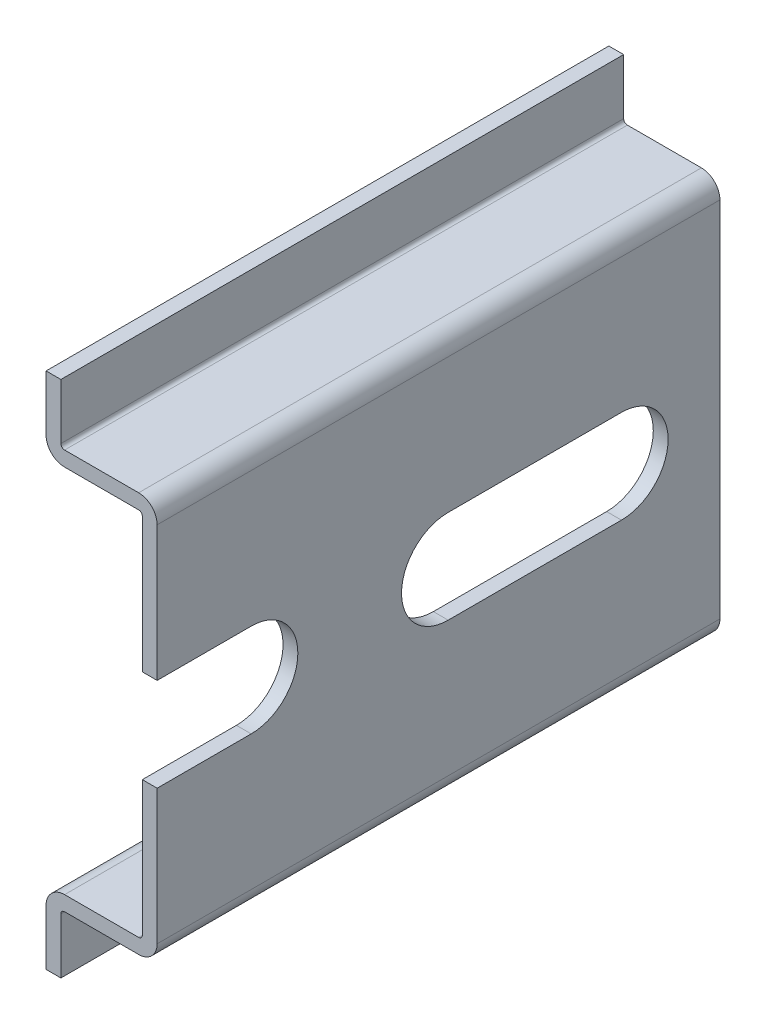
ISO-10303-21;
HEADER;
FILE_DESCRIPTION(('STEP AP214'),'2;1');
FILE_NAME('part.step','',(''),(''),'','','');
FILE_SCHEMA(('AUTOMOTIVE_DESIGN { 1 0 10303 214 1 1 1 1 }'));
ENDSEC;
DATA;
#1=APPLICATION_CONTEXT('core data for automotive mechanical design processes');
#2=APPLICATION_PROTOCOL_DEFINITION('international standard','automotive_design',2000,#1);
#3=PRODUCT_CONTEXT('',#1,'mechanical');
#4=PRODUCT('Part','Part','',(#3));
#5=PRODUCT_RELATED_PRODUCT_CATEGORY('part','',(#4));
#6=PRODUCT_DEFINITION_FORMATION('','',#4);
#7=PRODUCT_DEFINITION_CONTEXT('part definition',#1,'design');
#8=PRODUCT_DEFINITION('design','',#6,#7);
#9=PRODUCT_DEFINITION_SHAPE('','',#8);
#10=(LENGTH_UNIT() NAMED_UNIT(*) SI_UNIT(.MILLI.,.METRE.));
#11=(NAMED_UNIT(*) PLANE_ANGLE_UNIT() SI_UNIT($,.RADIAN.));
#12=(NAMED_UNIT(*) SI_UNIT($,.STERADIAN.) SOLID_ANGLE_UNIT());
#13=UNCERTAINTY_MEASURE_WITH_UNIT(LENGTH_MEASURE(1.E-05),#10,'distance_accuracy_value','');
#14=(GEOMETRIC_REPRESENTATION_CONTEXT(3) GLOBAL_UNCERTAINTY_ASSIGNED_CONTEXT((#13)) GLOBAL_UNIT_ASSIGNED_CONTEXT((#10,
#11,#12)) REPRESENTATION_CONTEXT('',''));
#15=CARTESIAN_POINT('',(0.,0.,0.));
#16=DIRECTION('',(0.,0.,1.));
#17=DIRECTION('',(1.,0.,0.));
#18=AXIS2_PLACEMENT_3D('',#15,#16,#17);
#19=CARTESIAN_POINT('',(-6.5,13.5,50.8));
#20=DIRECTION('',(-1.,0.,0.));
#21=DIRECTION('',(0.,-1.,0.));
#22=AXIS2_PLACEMENT_3D('',#19,#20,#21);
#23=PLANE('',#22);
#24=DIRECTION('',(0.,0.,-1.));
#25=VECTOR('',#24,1.);
#26=CARTESIAN_POINT('',(-6.5,17.5,50.8));
#27=LINE('',#26,#25);
#28=CARTESIAN_POINT('',(-6.5,17.5,38.));
#29=VERTEX_POINT('',#28);
#30=CARTESIAN_POINT('',(-6.5,17.5,0.));
#31=VERTEX_POINT('',#30);
#32=EDGE_CURVE('E239',#29,#31,#27,.T.);
#33=ORIENTED_EDGE('',*,*,#32,.F.);
#34=DIRECTION('',(0.,-1.,0.));
#35=VECTOR('',#34,1.);
#36=CARTESIAN_POINT('',(-6.5,13.5,38.));
#37=LINE('',#36,#35);
#38=CARTESIAN_POINT('',(-6.5,13.75,38.));
#39=VERTEX_POINT('',#38);
#40=EDGE_CURVE('E218',#29,#39,#37,.T.);
#41=ORIENTED_EDGE('',*,*,#40,.T.);
#42=DIRECTION('',(0.,0.,-1.));
#43=VECTOR('',#42,1.);
#44=CARTESIAN_POINT('',(-6.5,13.75,0.));
#45=LINE('',#44,#43);
#46=CARTESIAN_POINT('',(-6.5,13.75,0.));
#47=VERTEX_POINT('',#46);
#48=EDGE_CURVE('E267',#39,#47,#45,.T.);
#49=ORIENTED_EDGE('',*,*,#48,.T.);
#50=DIRECTION('',(0.,1.,0.));
#51=VECTOR('',#50,1.);
#52=CARTESIAN_POINT('',(-6.5,13.5,0.));
#53=LINE('',#52,#51);
#54=EDGE_CURVE('E439',#47,#31,#53,.T.);
#55=ORIENTED_EDGE('',*,*,#54,.T.);
#56=EDGE_LOOP('',(#33,#41,#49,#55));
#57=FACE_BOUND('',#56,.T.);
#58=ADVANCED_FACE('F33',(#57),#23,.F.);
#59=CARTESIAN_POINT('',(-7.5,17.5,50.8));
#60=DIRECTION('',(0.,1.,0.));
#61=DIRECTION('',(0.,0.,1.));
#62=AXIS2_PLACEMENT_3D('',#59,#60,#61);
#63=PLANE('',#62);
#64=DIRECTION('',(-1.,0.,0.));
#65=VECTOR('',#64,1.);
#66=CARTESIAN_POINT('',(0.,17.5,38.));
#67=LINE('',#66,#65);
#68=CARTESIAN_POINT('',(-7.5,17.5,38.));
#69=VERTEX_POINT('',#68);
#70=EDGE_CURVE('E215',#29,#69,#67,.T.);
#71=ORIENTED_EDGE('',*,*,#70,.F.);
#72=ORIENTED_EDGE('',*,*,#32,.T.);
#73=DIRECTION('',(1.,0.,0.));
#74=VECTOR('',#73,1.);
#75=CARTESIAN_POINT('',(-7.5,17.5,0.));
#76=LINE('',#75,#74);
#77=CARTESIAN_POINT('',(-7.5,17.5,0.));
#78=VERTEX_POINT('',#77);
#79=EDGE_CURVE('E238',#78,#31,#76,.T.);
#80=ORIENTED_EDGE('',*,*,#79,.F.);
#81=DIRECTION('',(0.,0.,-1.));
#82=VECTOR('',#81,1.);
#83=CARTESIAN_POINT('',(-7.5,17.5,50.8));
#84=LINE('',#83,#82);
#85=EDGE_CURVE('E229',#69,#78,#84,.T.);
#86=ORIENTED_EDGE('',*,*,#85,.F.);
#87=EDGE_LOOP('',(#71,#72,#80,#86));
#88=FACE_BOUND('',#87,.T.);
#89=ADVANCED_FACE('F236',(#88),#63,.T.);
#90=CARTESIAN_POINT('',(-7.5,13.5,50.8));
#91=DIRECTION('',(-1.,0.,0.));
#92=DIRECTION('',(0.,-1.,0.));
#93=AXIS2_PLACEMENT_3D('',#90,#91,#92);
#94=PLANE('',#93);
#95=DIRECTION('',(0.,-1.,0.));
#96=VECTOR('',#95,1.);
#97=CARTESIAN_POINT('',(-7.5,17.5,38.));
#98=LINE('',#97,#96);
#99=CARTESIAN_POINT('',(-7.5,13.75,38.));
#100=VERTEX_POINT('',#99);
#101=EDGE_CURVE('E55',#69,#100,#98,.T.);
#102=ORIENTED_EDGE('',*,*,#101,.F.);
#103=ORIENTED_EDGE('',*,*,#85,.T.);
#104=DIRECTION('',(0.,1.,0.));
#105=VECTOR('',#104,1.);
#106=CARTESIAN_POINT('',(-7.5,13.5,0.));
#107=LINE('',#106,#105);
#108=CARTESIAN_POINT('',(-7.5,13.75,0.));
#109=VERTEX_POINT('',#108);
#110=EDGE_CURVE('E337',#109,#78,#107,.T.);
#111=ORIENTED_EDGE('',*,*,#110,.F.);
#112=DIRECTION('',(0.,0.,-1.));
#113=VECTOR('',#112,1.);
#114=CARTESIAN_POINT('',(-7.5,13.75,50.8));
#115=LINE('',#114,#113);
#116=EDGE_CURVE('E41',#109,#100,#115,.F.);
#117=ORIENTED_EDGE('',*,*,#116,.T.);
#118=EDGE_LOOP('',(#102,#103,#111,#117));
#119=FACE_BOUND('',#118,.T.);
#120=ADVANCED_FACE('F227',(#119),#94,.T.);
#121=CARTESIAN_POINT('',(0.,12.5,50.8));
#122=DIRECTION('',(0.,-1.,0.));
#123=DIRECTION('',(1.,0.,0.));
#124=AXIS2_PLACEMENT_3D('',#121,#122,#123);
#125=PLANE('',#124);
#126=DIRECTION('',(1.,0.,0.));
#127=VECTOR('',#126,1.);
#128=CARTESIAN_POINT('',(0.,12.5,38.));
#129=LINE('',#128,#127);
#130=CARTESIAN_POINT('',(-6.25,12.5,38.));
#131=VERTEX_POINT('',#130);
#132=CARTESIAN_POINT('',(-1.25,12.5,38.));
#133=VERTEX_POINT('',#132);
#134=EDGE_CURVE('E329',#131,#133,#129,.T.);
#135=ORIENTED_EDGE('',*,*,#134,.F.);
#136=DIRECTION('',(0.,0.,-1.));
#137=VECTOR('',#136,1.);
#138=CARTESIAN_POINT('',(-6.25,12.5,50.8));
#139=LINE('',#138,#137);
#140=CARTESIAN_POINT('',(-6.25,12.5,0.));
#141=VERTEX_POINT('',#140);
#142=EDGE_CURVE('E319',#131,#141,#139,.T.);
#143=ORIENTED_EDGE('',*,*,#142,.T.);
#144=DIRECTION('',(-1.,0.,0.));
#145=VECTOR('',#144,1.);
#146=CARTESIAN_POINT('',(0.,12.5,0.));
#147=LINE('',#146,#145);
#148=CARTESIAN_POINT('',(-1.25,12.5,0.));
#149=VERTEX_POINT('',#148);
#150=EDGE_CURVE('E327',#149,#141,#147,.T.);
#151=ORIENTED_EDGE('',*,*,#150,.F.);
#152=DIRECTION('',(0.,0.,-1.));
#153=VECTOR('',#152,1.);
#154=CARTESIAN_POINT('',(-1.25,12.5,50.8));
#155=LINE('',#154,#153);
#156=EDGE_CURVE('E282',#149,#133,#155,.F.);
#157=ORIENTED_EDGE('',*,*,#156,.T.);
#158=EDGE_LOOP('',(#135,#143,#151,#157));
#159=FACE_BOUND('',#158,.T.);
#160=ADVANCED_FACE('F325',(#159),#125,.T.);
#161=CARTESIAN_POINT('',(-1.,-13.5,50.8));
#162=DIRECTION('',(-1.,0.,0.));
#163=DIRECTION('',(0.,-1.,0.));
#164=AXIS2_PLACEMENT_3D('',#161,#162,#163);
#165=PLANE('',#164);
#166=DIRECTION('',(0.,-1.,0.));
#167=VECTOR('',#166,1.);
#168=CARTESIAN_POINT('',(-1.,-13.5,38.));
#169=LINE('',#168,#167);
#170=CARTESIAN_POINT('',(-1.,12.25,38.));
#171=VERTEX_POINT('',#170);
#172=CARTESIAN_POINT('',(-1.,3.15,38.));
#173=VERTEX_POINT('',#172);
#174=EDGE_CURVE('E474',#171,#173,#169,.T.);
#175=ORIENTED_EDGE('',*,*,#174,.F.);
#176=DIRECTION('',(0.,0.,-1.));
#177=VECTOR('',#176,1.);
#178=CARTESIAN_POINT('',(-1.,12.25,0.));
#179=LINE('',#178,#177);
#180=CARTESIAN_POINT('',(-1.,12.25,0.));
#181=VERTEX_POINT('',#180);
#182=EDGE_CURVE('E280',#171,#181,#179,.T.);
#183=ORIENTED_EDGE('',*,*,#182,.T.);
#184=DIRECTION('',(0.,1.,0.));
#185=VECTOR('',#184,1.);
#186=CARTESIAN_POINT('',(-1.,-13.5,0.));
#187=LINE('',#186,#185);
#188=CARTESIAN_POINT('',(-1.,-12.25,0.));
#189=VERTEX_POINT('',#188);
#190=EDGE_CURVE('E336',#189,#181,#187,.T.);
#191=ORIENTED_EDGE('',*,*,#190,.F.);
#192=DIRECTION('',(0.,0.,-1.));
#193=VECTOR('',#192,1.);
#194=CARTESIAN_POINT('',(-1.,-12.25,50.8));
#195=LINE('',#194,#193);
#196=CARTESIAN_POINT('',(-1.,-12.25,38.));
#197=VERTEX_POINT('',#196);
#198=EDGE_CURVE('E277',#189,#197,#195,.F.);
#199=ORIENTED_EDGE('',*,*,#198,.T.);
#200=CARTESIAN_POINT('',(-1.,-3.15,38.));
#201=VERTEX_POINT('',#200);
#202=EDGE_CURVE('E402',#201,#197,#169,.T.);
#203=ORIENTED_EDGE('',*,*,#202,.F.);
#204=DIRECTION('',(0.,0.,1.));
#205=VECTOR('',#204,1.);
#206=CARTESIAN_POINT('',(-1.,-3.15,50.8));
#207=LINE('',#206,#205);
#208=CARTESIAN_POINT('',(-1.,-3.15,31.65));
#209=VERTEX_POINT('',#208);
#210=EDGE_CURVE('E414',#209,#201,#207,.T.);
#211=ORIENTED_EDGE('',*,*,#210,.F.);
#212=CARTESIAN_POINT('',(-1.,0.,31.65));
#213=DIRECTION('',(-1.,0.,0.));
#214=DIRECTION('',(0.,-1.,0.));
#215=AXIS2_PLACEMENT_3D('',#212,#213,#214);
#216=CIRCLE('',#215,3.14999999999999);
#217=CARTESIAN_POINT('',(-1.00000000000001,3.14999999999999,31.65));
#218=VERTEX_POINT('',#217);
#219=EDGE_CURVE('E417',#218,#209,#216,.T.);
#220=ORIENTED_EDGE('',*,*,#219,.F.);
#221=DIRECTION('',(0.,0.,-1.));
#222=VECTOR('',#221,1.);
#223=CARTESIAN_POINT('',(-1.,3.14999999999999,50.8));
#224=LINE('',#223,#222);
#225=EDGE_CURVE('E410',#173,#218,#224,.T.);
#226=ORIENTED_EDGE('',*,*,#225,.F.);
#227=EDGE_LOOP('',(#175,#183,#191,#199,#203,#211,#220,#226));
#228=FACE_BOUND('',#227,.T.);
#229=CARTESIAN_POINT('',(-1.,0.,6.65));
#230=DIRECTION('',(-1.,0.,0.));
#231=DIRECTION('',(0.,-1.,0.));
#232=AXIS2_PLACEMENT_3D('',#229,#230,#231);
#233=CIRCLE('',#232,3.14999999999999);
#234=CARTESIAN_POINT('',(-1.00000000000001,3.14999999999999,6.65));
#235=VERTEX_POINT('',#234);
#236=CARTESIAN_POINT('',(-1.,-3.15,6.65));
#237=VERTEX_POINT('',#236);
#238=EDGE_CURVE('E437',#235,#237,#233,.T.);
#239=ORIENTED_EDGE('',*,*,#238,.F.);
#240=DIRECTION('',(0.,0.,-1.));
#241=VECTOR('',#240,1.);
#242=CARTESIAN_POINT('',(-1.,3.15,50.8));
#243=LINE('',#242,#241);
#244=CARTESIAN_POINT('',(-1.,3.14999999999999,18.35));
#245=VERTEX_POINT('',#244);
#246=EDGE_CURVE('E427',#245,#235,#243,.T.);
#247=ORIENTED_EDGE('',*,*,#246,.F.);
#248=CARTESIAN_POINT('',(-1.,0.,18.35));
#249=DIRECTION('',(-1.,0.,0.));
#250=DIRECTION('',(0.,-1.,0.));
#251=AXIS2_PLACEMENT_3D('',#248,#249,#250);
#252=CIRCLE('',#251,3.14999999999999);
#253=CARTESIAN_POINT('',(-1.,-3.15,18.35));
#254=VERTEX_POINT('',#253);
#255=EDGE_CURVE('E432',#254,#245,#252,.T.);
#256=ORIENTED_EDGE('',*,*,#255,.F.);
#257=DIRECTION('',(0.,0.,1.));
#258=VECTOR('',#257,1.);
#259=CARTESIAN_POINT('',(-1.,-3.14999999999999,50.8));
#260=LINE('',#259,#258);
#261=EDGE_CURVE('E435',#237,#254,#260,.T.);
#262=ORIENTED_EDGE('',*,*,#261,.F.);
#263=EDGE_LOOP('',(#239,#247,#256,#262));
#264=FACE_BOUND('',#263,.T.);
#265=ADVANCED_FACE('F506',(#228,#264),#165,.T.);
#266=CARTESIAN_POINT('',(0.,-12.5,50.8));
#267=DIRECTION('',(0.,1.,0.));
#268=DIRECTION('',(-1.,0.,0.));
#269=AXIS2_PLACEMENT_3D('',#266,#267,#268);
#270=PLANE('',#269);
#271=DIRECTION('',(-1.,0.,0.));
#272=VECTOR('',#271,1.);
#273=CARTESIAN_POINT('',(0.,-12.5,38.));
#274=LINE('',#273,#272);
#275=CARTESIAN_POINT('',(-1.25,-12.5,38.));
#276=VERTEX_POINT('',#275);
#277=CARTESIAN_POINT('',(-6.25,-12.5,38.));
#278=VERTEX_POINT('',#277);
#279=EDGE_CURVE('E392',#276,#278,#274,.T.);
#280=ORIENTED_EDGE('',*,*,#279,.F.);
#281=DIRECTION('',(0.,0.,-1.));
#282=VECTOR('',#281,1.);
#283=CARTESIAN_POINT('',(-1.25,-12.5,0.));
#284=LINE('',#283,#282);
#285=CARTESIAN_POINT('',(-1.25,-12.5,0.));
#286=VERTEX_POINT('',#285);
#287=EDGE_CURVE('E285',#276,#286,#284,.T.);
#288=ORIENTED_EDGE('',*,*,#287,.T.);
#289=DIRECTION('',(1.,0.,0.));
#290=VECTOR('',#289,1.);
#291=CARTESIAN_POINT('',(0.,-12.5,0.));
#292=LINE('',#291,#290);
#293=CARTESIAN_POINT('',(-6.25,-12.5,0.));
#294=VERTEX_POINT('',#293);
#295=EDGE_CURVE('E339',#294,#286,#292,.T.);
#296=ORIENTED_EDGE('',*,*,#295,.F.);
#297=DIRECTION('',(0.,0.,-1.));
#298=VECTOR('',#297,1.);
#299=CARTESIAN_POINT('',(-6.25,-12.5,50.8));
#300=LINE('',#299,#298);
#301=EDGE_CURVE('E306',#294,#278,#300,.F.);
#302=ORIENTED_EDGE('',*,*,#301,.T.);
#303=EDGE_LOOP('',(#280,#288,#296,#302));
#304=FACE_BOUND('',#303,.T.);
#305=ADVANCED_FACE('F387',(#304),#270,.T.);
#306=CARTESIAN_POINT('',(-7.5,-13.5,50.8));
#307=DIRECTION('',(-1.,0.,0.));
#308=DIRECTION('',(0.,-1.,0.));
#309=AXIS2_PLACEMENT_3D('',#306,#307,#308);
#310=PLANE('',#309);
#311=CARTESIAN_POINT('',(-7.5,-13.75,38.));
#312=VERTEX_POINT('',#311);
#313=CARTESIAN_POINT('',(-7.50000000000001,-17.5,38.));
#314=VERTEX_POINT('',#313);
#315=EDGE_CURVE('E233',#312,#314,#98,.T.);
#316=ORIENTED_EDGE('',*,*,#315,.F.);
#317=DIRECTION('',(0.,0.,-1.));
#318=VECTOR('',#317,1.);
#319=CARTESIAN_POINT('',(-7.5,-13.75,50.8));
#320=LINE('',#319,#318);
#321=CARTESIAN_POINT('',(-7.5,-13.75,0.));
#322=VERTEX_POINT('',#321);
#323=EDGE_CURVE('E296',#312,#322,#320,.T.);
#324=ORIENTED_EDGE('',*,*,#323,.T.);
#325=DIRECTION('',(0.,1.,0.));
#326=VECTOR('',#325,1.);
#327=CARTESIAN_POINT('',(-7.5,-13.5,0.));
#328=LINE('',#327,#326);
#329=CARTESIAN_POINT('',(-7.5,-17.5,0.));
#330=VERTEX_POINT('',#329);
#331=EDGE_CURVE('E346',#330,#322,#328,.T.);
#332=ORIENTED_EDGE('',*,*,#331,.F.);
#333=DIRECTION('',(0.,0.,-1.));
#334=VECTOR('',#333,1.);
#335=CARTESIAN_POINT('',(-7.5,-17.5,50.8));
#336=LINE('',#335,#334);
#337=EDGE_CURVE('E240',#314,#330,#336,.T.);
#338=ORIENTED_EDGE('',*,*,#337,.F.);
#339=EDGE_LOOP('',(#316,#324,#332,#338));
#340=FACE_BOUND('',#339,.T.);
#341=ADVANCED_FACE('F378',(#340),#310,.T.);
#342=CARTESIAN_POINT('',(-6.5,-17.5,50.8));
#343=DIRECTION('',(0.,-1.,0.));
#344=DIRECTION('',(0.,0.,-1.));
#345=AXIS2_PLACEMENT_3D('',#342,#343,#344);
#346=PLANE('',#345);
#347=DIRECTION('',(-1.,0.,0.));
#348=VECTOR('',#347,1.);
#349=CARTESIAN_POINT('',(0.,-17.5,38.));
#350=LINE('',#349,#348);
#351=CARTESIAN_POINT('',(-6.5,-17.5,38.));
#352=VERTEX_POINT('',#351);
#353=EDGE_CURVE('E222',#352,#314,#350,.T.);
#354=ORIENTED_EDGE('',*,*,#353,.T.);
#355=ORIENTED_EDGE('',*,*,#337,.T.);
#356=DIRECTION('',(-1.,0.,0.));
#357=VECTOR('',#356,1.);
#358=CARTESIAN_POINT('',(-6.5,-17.5,0.));
#359=LINE('',#358,#357);
#360=CARTESIAN_POINT('',(-6.5,-17.5,0.));
#361=VERTEX_POINT('',#360);
#362=EDGE_CURVE('E348',#361,#330,#359,.T.);
#363=ORIENTED_EDGE('',*,*,#362,.F.);
#364=DIRECTION('',(0.,0.,-1.));
#365=VECTOR('',#364,1.);
#366=CARTESIAN_POINT('',(-6.5,-17.5,50.8));
#367=LINE('',#366,#365);
#368=EDGE_CURVE('E244',#352,#361,#367,.T.);
#369=ORIENTED_EDGE('',*,*,#368,.F.);
#370=EDGE_LOOP('',(#354,#355,#363,#369));
#371=FACE_BOUND('',#370,.T.);
#372=ADVANCED_FACE('F373',(#371),#346,.T.);
#373=CARTESIAN_POINT('',(-6.5,-13.5,50.8));
#374=DIRECTION('',(-1.,0.,0.));
#375=DIRECTION('',(0.,-1.,0.));
#376=AXIS2_PLACEMENT_3D('',#373,#374,#375);
#377=PLANE('',#376);
#378=DIRECTION('',(0.,0.,-1.));
#379=VECTOR('',#378,1.);
#380=CARTESIAN_POINT('',(-6.5,-13.75,50.8));
#381=LINE('',#380,#379);
#382=CARTESIAN_POINT('',(-6.5,-13.75,0.));
#383=VERTEX_POINT('',#382);
#384=CARTESIAN_POINT('',(-6.5,-13.75,38.));
#385=VERTEX_POINT('',#384);
#386=EDGE_CURVE('E274',#383,#385,#381,.F.);
#387=ORIENTED_EDGE('',*,*,#386,.T.);
#388=DIRECTION('',(0.,-1.,0.));
#389=VECTOR('',#388,1.);
#390=CARTESIAN_POINT('',(-6.5,-13.5,38.));
#391=LINE('',#390,#389);
#392=EDGE_CURVE('E367',#385,#352,#391,.T.);
#393=ORIENTED_EDGE('',*,*,#392,.T.);
#394=ORIENTED_EDGE('',*,*,#368,.T.);
#395=DIRECTION('',(0.,1.,0.));
#396=VECTOR('',#395,1.);
#397=CARTESIAN_POINT('',(-6.5,-13.5,0.));
#398=LINE('',#397,#396);
#399=EDGE_CURVE('E351',#361,#383,#398,.T.);
#400=ORIENTED_EDGE('',*,*,#399,.T.);
#401=EDGE_LOOP('',(#387,#393,#394,#400));
#402=FACE_BOUND('',#401,.T.);
#403=ADVANCED_FACE('F365',(#402),#377,.F.);
#404=CARTESIAN_POINT('',(0.,-13.5,50.8));
#405=DIRECTION('',(0.,1.,0.));
#406=DIRECTION('',(-1.,0.,0.));
#407=AXIS2_PLACEMENT_3D('',#404,#405,#406);
#408=PLANE('',#407);
#409=DIRECTION('',(0.,0.,-1.));
#410=VECTOR('',#409,1.);
#411=CARTESIAN_POINT('',(-1.25,-13.5,50.8));
#412=LINE('',#411,#410);
#413=CARTESIAN_POINT('',(-1.25,-13.5,0.));
#414=VERTEX_POINT('',#413);
#415=CARTESIAN_POINT('',(-1.25,-13.5,38.));
#416=VERTEX_POINT('',#415);
#417=EDGE_CURVE('E314',#414,#416,#412,.F.);
#418=ORIENTED_EDGE('',*,*,#417,.T.);
#419=DIRECTION('',(-1.,0.,0.));
#420=VECTOR('',#419,1.);
#421=CARTESIAN_POINT('',(0.,-13.5,38.));
#422=LINE('',#421,#420);
#423=CARTESIAN_POINT('',(-6.25,-13.5,38.));
#424=VERTEX_POINT('',#423);
#425=EDGE_CURVE('E48',#416,#424,#422,.T.);
#426=ORIENTED_EDGE('',*,*,#425,.T.);
#427=DIRECTION('',(0.,0.,-1.));
#428=VECTOR('',#427,1.);
#429=CARTESIAN_POINT('',(-6.25,-13.5,0.));
#430=LINE('',#429,#428);
#431=CARTESIAN_POINT('',(-6.25,-13.5,0.));
#432=VERTEX_POINT('',#431);
#433=EDGE_CURVE('E272',#424,#432,#430,.T.);
#434=ORIENTED_EDGE('',*,*,#433,.T.);
#435=DIRECTION('',(1.,0.,0.));
#436=VECTOR('',#435,1.);
#437=CARTESIAN_POINT('',(0.,-13.5,0.));
#438=LINE('',#437,#436);
#439=EDGE_CURVE('E354',#432,#414,#438,.T.);
#440=ORIENTED_EDGE('',*,*,#439,.T.);
#441=EDGE_LOOP('',(#418,#426,#434,#440));
#442=FACE_BOUND('',#441,.T.);
#443=ADVANCED_FACE('F488',(#442),#408,.F.);
#444=CARTESIAN_POINT('',(0.,-13.5,50.8));
#445=DIRECTION('',(-1.,0.,0.));
#446=DIRECTION('',(0.,-1.,0.));
#447=AXIS2_PLACEMENT_3D('',#444,#445,#446);
#448=PLANE('',#447);
#449=DIRECTION('',(0.,0.,-1.));
#450=VECTOR('',#449,1.);
#451=CARTESIAN_POINT('',(0.,12.25,50.8));
#452=LINE('',#451,#450);
#453=CARTESIAN_POINT('',(0.,12.25,0.));
#454=VERTEX_POINT('',#453);
#455=CARTESIAN_POINT('',(0.,12.25,38.));
#456=VERTEX_POINT('',#455);
#457=EDGE_CURVE('E309',#454,#456,#452,.F.);
#458=ORIENTED_EDGE('',*,*,#457,.T.);
#459=DIRECTION('',(0.,-1.,0.));
#460=VECTOR('',#459,1.);
#461=CARTESIAN_POINT('',(0.,17.5,38.));
#462=LINE('',#461,#460);
#463=CARTESIAN_POINT('',(0.,3.14999999999999,38.));
#464=VERTEX_POINT('',#463);
#465=EDGE_CURVE('E223',#456,#464,#462,.T.);
#466=ORIENTED_EDGE('',*,*,#465,.T.);
#467=DIRECTION('',(0.,0.,1.));
#468=VECTOR('',#467,1.);
#469=CARTESIAN_POINT('',(0.,3.14999999999999,50.8));
#470=LINE('',#469,#468);
#471=CARTESIAN_POINT('',(0.,3.14999999999999,31.65));
#472=VERTEX_POINT('',#471);
#473=EDGE_CURVE('E259',#464,#472,#470,.F.);
#474=ORIENTED_EDGE('',*,*,#473,.T.);
#475=CARTESIAN_POINT('',(0.,0.,31.65));
#476=DIRECTION('',(1.,0.,0.));
#477=DIRECTION('',(0.,0.,-1.));
#478=AXIS2_PLACEMENT_3D('',#475,#476,#477);
#479=CIRCLE('',#478,3.14999999999999);
#480=CARTESIAN_POINT('',(0.,-3.15,31.65));
#481=VERTEX_POINT('',#480);
#482=EDGE_CURVE('E264',#472,#481,#479,.F.);
#483=ORIENTED_EDGE('',*,*,#482,.T.);
#484=DIRECTION('',(0.,0.,1.));
#485=VECTOR('',#484,1.);
#486=CARTESIAN_POINT('',(0.,-3.15,50.8));
#487=LINE('',#486,#485);
#488=CARTESIAN_POINT('',(0.,-3.15,38.));
#489=VERTEX_POINT('',#488);
#490=EDGE_CURVE('E261',#481,#489,#487,.T.);
#491=ORIENTED_EDGE('',*,*,#490,.T.);
#492=CARTESIAN_POINT('',(0.,-12.25,38.));
#493=VERTEX_POINT('',#492);
#494=EDGE_CURVE('E232',#489,#493,#462,.T.);
#495=ORIENTED_EDGE('',*,*,#494,.T.);
#496=DIRECTION('',(0.,0.,-1.));
#497=VECTOR('',#496,1.);
#498=CARTESIAN_POINT('',(0.,-12.25,50.8));
#499=LINE('',#498,#497);
#500=CARTESIAN_POINT('',(0.,-12.25,0.));
#501=VERTEX_POINT('',#500);
#502=EDGE_CURVE('E312',#493,#501,#499,.T.);
#503=ORIENTED_EDGE('',*,*,#502,.T.);
#504=DIRECTION('',(0.,1.,0.));
#505=VECTOR('',#504,1.);
#506=CARTESIAN_POINT('',(0.,-13.5,0.));
#507=LINE('',#506,#505);
#508=EDGE_CURVE('E357',#501,#454,#507,.T.);
#509=ORIENTED_EDGE('',*,*,#508,.T.);
#510=EDGE_LOOP('',(#458,#466,#474,#483,#491,#495,#503,#509));
#511=FACE_BOUND('',#510,.T.);
#512=DIRECTION('',(0.,0.,1.));
#513=VECTOR('',#512,1.);
#514=CARTESIAN_POINT('',(0.,3.14999999999999,50.8));
#515=LINE('',#514,#513);
#516=CARTESIAN_POINT('',(0.,3.15,18.35));
#517=VERTEX_POINT('',#516);
#518=CARTESIAN_POINT('',(0.,3.14999999999999,6.65));
#519=VERTEX_POINT('',#518);
#520=EDGE_CURVE('E242',#517,#519,#515,.F.);
#521=ORIENTED_EDGE('',*,*,#520,.T.);
#522=CARTESIAN_POINT('',(0.,0.,6.65));
#523=DIRECTION('',(1.,0.,0.));
#524=DIRECTION('',(0.,0.,-1.));
#525=AXIS2_PLACEMENT_3D('',#522,#523,#524);
#526=CIRCLE('',#525,3.14999999999999);
#527=CARTESIAN_POINT('',(0.,-3.15,6.65));
#528=VERTEX_POINT('',#527);
#529=EDGE_CURVE('E256',#519,#528,#526,.F.);
#530=ORIENTED_EDGE('',*,*,#529,.T.);
#531=DIRECTION('',(0.,0.,1.));
#532=VECTOR('',#531,1.);
#533=CARTESIAN_POINT('',(0.,-3.15,50.8));
#534=LINE('',#533,#532);
#535=CARTESIAN_POINT('',(0.,-3.15,18.35));
#536=VERTEX_POINT('',#535);
#537=EDGE_CURVE('E253',#528,#536,#534,.T.);
#538=ORIENTED_EDGE('',*,*,#537,.T.);
#539=CARTESIAN_POINT('',(0.,0.,18.35));
#540=DIRECTION('',(1.,0.,0.));
#541=DIRECTION('',(0.,0.,-1.));
#542=AXIS2_PLACEMENT_3D('',#539,#540,#541);
#543=CIRCLE('',#542,3.14999999999999);
#544=EDGE_CURVE('E250',#536,#517,#543,.F.);
#545=ORIENTED_EDGE('',*,*,#544,.T.);
#546=EDGE_LOOP('',(#521,#530,#538,#545));
#547=FACE_BOUND('',#546,.T.);
#548=ADVANCED_FACE('F461',(#511,#547),#448,.F.);
#549=CARTESIAN_POINT('',(0.,13.5,50.8));
#550=DIRECTION('',(0.,-1.,0.));
#551=DIRECTION('',(1.,0.,0.));
#552=AXIS2_PLACEMENT_3D('',#549,#550,#551);
#553=PLANE('',#552);
#554=DIRECTION('',(0.,0.,-1.));
#555=VECTOR('',#554,1.);
#556=CARTESIAN_POINT('',(-6.25,13.5,50.8));
#557=LINE('',#556,#555);
#558=CARTESIAN_POINT('',(-6.25,13.5,0.));
#559=VERTEX_POINT('',#558);
#560=CARTESIAN_POINT('',(-6.25,13.5,38.));
#561=VERTEX_POINT('',#560);
#562=EDGE_CURVE('E269',#559,#561,#557,.F.);
#563=ORIENTED_EDGE('',*,*,#562,.T.);
#564=DIRECTION('',(1.,0.,0.));
#565=VECTOR('',#564,1.);
#566=CARTESIAN_POINT('',(0.,13.5,38.));
#567=LINE('',#566,#565);
#568=CARTESIAN_POINT('',(-1.25000000000001,13.5,38.));
#569=VERTEX_POINT('',#568);
#570=EDGE_CURVE('E454',#561,#569,#567,.T.);
#571=ORIENTED_EDGE('',*,*,#570,.T.);
#572=DIRECTION('',(0.,0.,-1.));
#573=VECTOR('',#572,1.);
#574=CARTESIAN_POINT('',(-1.25000000000001,13.5,50.8));
#575=LINE('',#574,#573);
#576=CARTESIAN_POINT('',(-1.25000000000001,13.5,0.));
#577=VERTEX_POINT('',#576);
#578=EDGE_CURVE('E317',#569,#577,#575,.T.);
#579=ORIENTED_EDGE('',*,*,#578,.T.);
#580=DIRECTION('',(-1.,0.,0.));
#581=VECTOR('',#580,1.);
#582=CARTESIAN_POINT('',(0.,13.5,0.));
#583=LINE('',#582,#581);
#584=EDGE_CURVE('E360',#577,#559,#583,.T.);
#585=ORIENTED_EDGE('',*,*,#584,.T.);
#586=EDGE_LOOP('',(#563,#571,#579,#585));
#587=FACE_BOUND('',#586,.T.);
#588=ADVANCED_FACE('F453',(#587),#553,.F.);
#589=CARTESIAN_POINT('',(0.,0.,0.));
#590=DIRECTION('',(0.,0.,-1.));
#591=DIRECTION('',(-1.,0.,0.));
#592=AXIS2_PLACEMENT_3D('',#589,#590,#591);
#593=PLANE('',#592);
#594=ORIENTED_EDGE('',*,*,#331,.T.);
#595=CARTESIAN_POINT('',(-6.25,-13.75,0.));
#596=DIRECTION('',(0.,0.,-1.));
#597=DIRECTION('',(-1.,0.,0.));
#598=AXIS2_PLACEMENT_3D('',#595,#596,#597);
#599=CIRCLE('',#598,1.25);
#600=EDGE_CURVE('E304',#322,#294,#599,.T.);
#601=ORIENTED_EDGE('',*,*,#600,.T.);
#602=ORIENTED_EDGE('',*,*,#295,.T.);
#603=CARTESIAN_POINT('',(-1.25,-12.25,0.));
#604=DIRECTION('',(0.,0.,-1.));
#605=DIRECTION('',(-1.,0.,0.));
#606=AXIS2_PLACEMENT_3D('',#603,#604,#605);
#607=CIRCLE('',#606,0.25);
#608=EDGE_CURVE('E294',#286,#189,#607,.F.);
#609=ORIENTED_EDGE('',*,*,#608,.T.);
#610=ORIENTED_EDGE('',*,*,#190,.T.);
#611=CARTESIAN_POINT('',(-1.25,12.25,0.));
#612=DIRECTION('',(0.,0.,-1.));
#613=DIRECTION('',(-1.,0.,0.));
#614=AXIS2_PLACEMENT_3D('',#611,#612,#613);
#615=CIRCLE('',#614,0.25);
#616=EDGE_CURVE('E292',#181,#149,#615,.F.);
#617=ORIENTED_EDGE('',*,*,#616,.T.);
#618=ORIENTED_EDGE('',*,*,#150,.T.);
#619=CARTESIAN_POINT('',(-6.25,13.75,0.));
#620=DIRECTION('',(0.,0.,-1.));
#621=DIRECTION('',(-1.,0.,0.));
#622=AXIS2_PLACEMENT_3D('',#619,#620,#621);
#623=CIRCLE('',#622,1.25);
#624=EDGE_CURVE('E298',#141,#109,#623,.T.);
#625=ORIENTED_EDGE('',*,*,#624,.T.);
#626=ORIENTED_EDGE('',*,*,#110,.T.);
#627=ORIENTED_EDGE('',*,*,#79,.T.);
#628=ORIENTED_EDGE('',*,*,#54,.F.);
#629=CARTESIAN_POINT('',(-6.25,13.75,0.));
#630=DIRECTION('',(0.,0.,-1.));
#631=DIRECTION('',(-1.,0.,0.));
#632=AXIS2_PLACEMENT_3D('',#629,#630,#631);
#633=CIRCLE('',#632,0.25);
#634=EDGE_CURVE('E287',#47,#559,#633,.F.);
#635=ORIENTED_EDGE('',*,*,#634,.T.);
#636=ORIENTED_EDGE('',*,*,#584,.F.);
#637=CARTESIAN_POINT('',(-1.25,12.25,0.));
#638=DIRECTION('',(0.,0.,-1.));
#639=DIRECTION('',(-1.,0.,0.));
#640=AXIS2_PLACEMENT_3D('',#637,#638,#639);
#641=CIRCLE('',#640,1.25);
#642=EDGE_CURVE('E300',#577,#454,#641,.T.);
#643=ORIENTED_EDGE('',*,*,#642,.T.);
#644=ORIENTED_EDGE('',*,*,#508,.F.);
#645=CARTESIAN_POINT('',(-1.25,-12.25,0.));
#646=DIRECTION('',(0.,0.,-1.));
#647=DIRECTION('',(-1.,0.,0.));
#648=AXIS2_PLACEMENT_3D('',#645,#646,#647);
#649=CIRCLE('',#648,1.25);
#650=EDGE_CURVE('E302',#501,#414,#649,.T.);
#651=ORIENTED_EDGE('',*,*,#650,.T.);
#652=ORIENTED_EDGE('',*,*,#439,.F.);
#653=CARTESIAN_POINT('',(-6.25,-13.75,0.));
#654=DIRECTION('',(0.,0.,-1.));
#655=DIRECTION('',(-1.,0.,0.));
#656=AXIS2_PLACEMENT_3D('',#653,#654,#655);
#657=CIRCLE('',#656,0.25);
#658=EDGE_CURVE('E290',#432,#383,#657,.F.);
#659=ORIENTED_EDGE('',*,*,#658,.T.);
#660=ORIENTED_EDGE('',*,*,#399,.F.);
#661=ORIENTED_EDGE('',*,*,#362,.T.);
#662=EDGE_LOOP('',(#594,#601,#602,#609,#610,#617,#618,#625,#626,#627,#628,#635,#636,#643,#644,
#651,#652,#659,#660,#661));
#663=FACE_BOUND('',#662,.T.);
#664=ADVANCED_FACE('F333',(#663),#593,.T.);
#665=CARTESIAN_POINT('',(-7.5,0.,6.65));
#666=DIRECTION('',(1.,0.,0.));
#667=DIRECTION('',(0.,0.,-1.));
#668=AXIS2_PLACEMENT_3D('',#665,#666,#667);
#669=CYLINDRICAL_SURFACE('',#668,3.14999999999999);
#670=ORIENTED_EDGE('',*,*,#238,.T.);
#671=DIRECTION('',(1.,0.,0.));
#672=VECTOR('',#671,1.);
#673=CARTESIAN_POINT('',(-7.5,-3.15,6.65));
#674=LINE('',#673,#672);
#675=EDGE_CURVE('E423',#237,#528,#674,.T.);
#676=ORIENTED_EDGE('',*,*,#675,.T.);
#677=ORIENTED_EDGE('',*,*,#529,.F.);
#678=DIRECTION('',(1.,0.,0.));
#679=VECTOR('',#678,1.);
#680=CARTESIAN_POINT('',(-7.5,3.14999999999999,6.65));
#681=LINE('',#680,#679);
#682=EDGE_CURVE('E419',#235,#519,#681,.T.);
#683=ORIENTED_EDGE('',*,*,#682,.F.);
#684=EDGE_LOOP('',(#670,#676,#677,#683));
#685=FACE_BOUND('',#684,.T.);
#686=ADVANCED_FACE('F553',(#685),#669,.F.);
#687=CARTESIAN_POINT('',(-7.5,-3.15,6.65));
#688=DIRECTION('',(0.,-1.,0.));
#689=DIRECTION('',(0.,0.,-1.));
#690=AXIS2_PLACEMENT_3D('',#687,#688,#689);
#691=PLANE('',#690);
#692=ORIENTED_EDGE('',*,*,#261,.T.);
#693=DIRECTION('',(1.,0.,0.));
#694=VECTOR('',#693,1.);
#695=CARTESIAN_POINT('',(-7.5,-3.15,18.35));
#696=LINE('',#695,#694);
#697=EDGE_CURVE('E420',#254,#536,#696,.T.);
#698=ORIENTED_EDGE('',*,*,#697,.T.);
#699=ORIENTED_EDGE('',*,*,#537,.F.);
#700=ORIENTED_EDGE('',*,*,#675,.F.);
#701=EDGE_LOOP('',(#692,#698,#699,#700));
#702=FACE_BOUND('',#701,.T.);
#703=ADVANCED_FACE('F549',(#702),#691,.F.);
#704=CARTESIAN_POINT('',(-7.5,0.,18.35));
#705=DIRECTION('',(1.,0.,0.));
#706=DIRECTION('',(0.,0.,-1.));
#707=AXIS2_PLACEMENT_3D('',#704,#705,#706);
#708=CYLINDRICAL_SURFACE('',#707,3.14999999999999);
#709=ORIENTED_EDGE('',*,*,#255,.T.);
#710=DIRECTION('',(1.,0.,0.));
#711=VECTOR('',#710,1.);
#712=CARTESIAN_POINT('',(-7.5,3.15000000000001,18.35));
#713=LINE('',#712,#711);
#714=EDGE_CURVE('E424',#245,#517,#713,.T.);
#715=ORIENTED_EDGE('',*,*,#714,.T.);
#716=ORIENTED_EDGE('',*,*,#544,.F.);
#717=ORIENTED_EDGE('',*,*,#697,.F.);
#718=EDGE_LOOP('',(#709,#715,#716,#717));
#719=FACE_BOUND('',#718,.T.);
#720=ADVANCED_FACE('F552',(#719),#708,.F.);
#721=CARTESIAN_POINT('',(-7.5,3.14999999999999,6.65));
#722=DIRECTION('',(0.,1.,0.));
#723=DIRECTION('',(0.,0.,1.));
#724=AXIS2_PLACEMENT_3D('',#721,#722,#723);
#725=PLANE('',#724);
#726=ORIENTED_EDGE('',*,*,#246,.T.);
#727=ORIENTED_EDGE('',*,*,#682,.T.);
#728=ORIENTED_EDGE('',*,*,#520,.F.);
#729=ORIENTED_EDGE('',*,*,#714,.F.);
#730=EDGE_LOOP('',(#726,#727,#728,#729));
#731=FACE_BOUND('',#730,.T.);
#732=ADVANCED_FACE('F547',(#731),#725,.F.);
#733=CARTESIAN_POINT('',(-7.5,0.,31.65));
#734=DIRECTION('',(1.,0.,0.));
#735=DIRECTION('',(0.,0.,-1.));
#736=AXIS2_PLACEMENT_3D('',#733,#734,#735);
#737=CYLINDRICAL_SURFACE('',#736,3.14999999999999);
#738=ORIENTED_EDGE('',*,*,#219,.T.);
#739=DIRECTION('',(1.,0.,0.));
#740=VECTOR('',#739,1.);
#741=CARTESIAN_POINT('',(-7.5,-3.15,31.65));
#742=LINE('',#741,#740);
#743=EDGE_CURVE('E407',#209,#481,#742,.T.);
#744=ORIENTED_EDGE('',*,*,#743,.T.);
#745=ORIENTED_EDGE('',*,*,#482,.F.);
#746=DIRECTION('',(1.,0.,0.));
#747=VECTOR('',#746,1.);
#748=CARTESIAN_POINT('',(-7.5,3.14999999999999,31.65));
#749=LINE('',#748,#747);
#750=EDGE_CURVE('E406',#218,#472,#749,.T.);
#751=ORIENTED_EDGE('',*,*,#750,.F.);
#752=EDGE_LOOP('',(#738,#744,#745,#751));
#753=FACE_BOUND('',#752,.T.);
#754=ADVANCED_FACE('F539',(#753),#737,.F.);
#755=CARTESIAN_POINT('',(-7.5,-3.15,31.65));
#756=DIRECTION('',(0.,-1.,0.));
#757=DIRECTION('',(0.,0.,-1.));
#758=AXIS2_PLACEMENT_3D('',#755,#756,#757);
#759=PLANE('',#758);
#760=ORIENTED_EDGE('',*,*,#210,.T.);
#761=DIRECTION('',(1.,0.,0.));
#762=VECTOR('',#761,1.);
#763=CARTESIAN_POINT('',(-7.5,-3.15,38.));
#764=LINE('',#763,#762);
#765=EDGE_CURVE('E403',#201,#489,#764,.T.);
#766=ORIENTED_EDGE('',*,*,#765,.T.);
#767=ORIENTED_EDGE('',*,*,#490,.F.);
#768=ORIENTED_EDGE('',*,*,#743,.F.);
#769=EDGE_LOOP('',(#760,#766,#767,#768));
#770=FACE_BOUND('',#769,.T.);
#771=ADVANCED_FACE('F533',(#770),#759,.F.);
#772=CARTESIAN_POINT('',(-7.5,3.14999999999999,31.65));
#773=DIRECTION('',(0.,1.,0.));
#774=DIRECTION('',(0.,0.,1.));
#775=AXIS2_PLACEMENT_3D('',#772,#773,#774);
#776=PLANE('',#775);
#777=ORIENTED_EDGE('',*,*,#473,.F.);
#778=DIRECTION('',(-1.,0.,0.));
#779=VECTOR('',#778,1.);
#780=CARTESIAN_POINT('',(-7.5,3.14999999999999,38.));
#781=LINE('',#780,#779);
#782=EDGE_CURVE('E470',#464,#173,#781,.T.);
#783=ORIENTED_EDGE('',*,*,#782,.T.);
#784=ORIENTED_EDGE('',*,*,#225,.T.);
#785=ORIENTED_EDGE('',*,*,#750,.T.);
#786=EDGE_LOOP('',(#777,#783,#784,#785));
#787=FACE_BOUND('',#786,.T.);
#788=ADVANCED_FACE('F529',(#787),#776,.F.);
#789=CARTESIAN_POINT('',(-6.25,13.75,50.8));
#790=DIRECTION('',(0.,0.,1.));
#791=DIRECTION('',(1.,0.,0.));
#792=AXIS2_PLACEMENT_3D('',#789,#790,#791);
#793=CYLINDRICAL_SURFACE('',#792,0.25);
#794=ORIENTED_EDGE('',*,*,#48,.F.);
#795=CARTESIAN_POINT('',(-6.25,13.75,38.));
#796=DIRECTION('',(0.,0.,-1.));
#797=DIRECTION('',(-1.,0.,0.));
#798=AXIS2_PLACEMENT_3D('',#795,#796,#797);
#799=CIRCLE('',#798,0.25);
#800=EDGE_CURVE('E450',#39,#561,#799,.F.);
#801=ORIENTED_EDGE('',*,*,#800,.T.);
#802=ORIENTED_EDGE('',*,*,#562,.F.);
#803=ORIENTED_EDGE('',*,*,#634,.F.);
#804=EDGE_LOOP('',(#794,#801,#802,#803));
#805=FACE_BOUND('',#804,.T.);
#806=ADVANCED_FACE('F449',(#805),#793,.F.);
#807=CARTESIAN_POINT('',(-6.25,-13.75,50.8));
#808=DIRECTION('',(0.,0.,1.));
#809=DIRECTION('',(1.,0.,0.));
#810=AXIS2_PLACEMENT_3D('',#807,#808,#809);
#811=CYLINDRICAL_SURFACE('',#810,0.25);
#812=ORIENTED_EDGE('',*,*,#433,.F.);
#813=CARTESIAN_POINT('',(-6.25,-13.75,38.));
#814=DIRECTION('',(0.,0.,-1.));
#815=DIRECTION('',(-1.,0.,0.));
#816=AXIS2_PLACEMENT_3D('',#813,#814,#815);
#817=CIRCLE('',#816,0.25);
#818=EDGE_CURVE('E396',#424,#385,#817,.F.);
#819=ORIENTED_EDGE('',*,*,#818,.T.);
#820=ORIENTED_EDGE('',*,*,#386,.F.);
#821=ORIENTED_EDGE('',*,*,#658,.F.);
#822=EDGE_LOOP('',(#812,#819,#820,#821));
#823=FACE_BOUND('',#822,.T.);
#824=ADVANCED_FACE('F485',(#823),#811,.F.);
#825=CARTESIAN_POINT('',(-1.25,12.25,50.8));
#826=DIRECTION('',(0.,0.,1.));
#827=DIRECTION('',(1.,0.,0.));
#828=AXIS2_PLACEMENT_3D('',#825,#826,#827);
#829=CYLINDRICAL_SURFACE('',#828,0.25);
#830=ORIENTED_EDGE('',*,*,#182,.F.);
#831=CARTESIAN_POINT('',(-1.25,12.25,38.));
#832=DIRECTION('',(0.,0.,-1.));
#833=DIRECTION('',(-1.,0.,0.));
#834=AXIS2_PLACEMENT_3D('',#831,#832,#833);
#835=CIRCLE('',#834,0.25);
#836=EDGE_CURVE('E496',#171,#133,#835,.F.);
#837=ORIENTED_EDGE('',*,*,#836,.T.);
#838=ORIENTED_EDGE('',*,*,#156,.F.);
#839=ORIENTED_EDGE('',*,*,#616,.F.);
#840=EDGE_LOOP('',(#830,#837,#838,#839));
#841=FACE_BOUND('',#840,.T.);
#842=ADVANCED_FACE('F511',(#841),#829,.F.);
#843=CARTESIAN_POINT('',(-1.25,-12.25,50.8));
#844=DIRECTION('',(0.,0.,1.));
#845=DIRECTION('',(1.,0.,0.));
#846=AXIS2_PLACEMENT_3D('',#843,#844,#845);
#847=CYLINDRICAL_SURFACE('',#846,0.25);
#848=ORIENTED_EDGE('',*,*,#287,.F.);
#849=CARTESIAN_POINT('',(-1.25,-12.25,38.));
#850=DIRECTION('',(0.,0.,-1.));
#851=DIRECTION('',(-1.,0.,0.));
#852=AXIS2_PLACEMENT_3D('',#849,#850,#851);
#853=CIRCLE('',#852,0.25);
#854=EDGE_CURVE('E394',#276,#197,#853,.F.);
#855=ORIENTED_EDGE('',*,*,#854,.T.);
#856=ORIENTED_EDGE('',*,*,#198,.F.);
#857=ORIENTED_EDGE('',*,*,#608,.F.);
#858=EDGE_LOOP('',(#848,#855,#856,#857));
#859=FACE_BOUND('',#858,.T.);
#860=ADVANCED_FACE('F504',(#859),#847,.F.);
#861=CARTESIAN_POINT('',(-6.25,-13.75,50.8));
#862=DIRECTION('',(0.,0.,-1.));
#863=DIRECTION('',(-1.,0.,0.));
#864=AXIS2_PLACEMENT_3D('',#861,#862,#863);
#865=CYLINDRICAL_SURFACE('',#864,1.25);
#866=CARTESIAN_POINT('',(-6.25,-13.75,38.));
#867=DIRECTION('',(0.,0.,-1.));
#868=DIRECTION('',(-1.,0.,0.));
#869=AXIS2_PLACEMENT_3D('',#866,#867,#868);
#870=CIRCLE('',#869,1.25);
#871=EDGE_CURVE('E391',#278,#312,#870,.F.);
#872=ORIENTED_EDGE('',*,*,#871,.F.);
#873=ORIENTED_EDGE('',*,*,#301,.F.);
#874=ORIENTED_EDGE('',*,*,#600,.F.);
#875=ORIENTED_EDGE('',*,*,#323,.F.);
#876=EDGE_LOOP('',(#872,#873,#874,#875));
#877=FACE_BOUND('',#876,.T.);
#878=ADVANCED_FACE('F390',(#877),#865,.T.);
#879=CARTESIAN_POINT('',(-1.25,-12.25,50.8));
#880=DIRECTION('',(0.,0.,-1.));
#881=DIRECTION('',(-1.,0.,0.));
#882=AXIS2_PLACEMENT_3D('',#879,#880,#881);
#883=CYLINDRICAL_SURFACE('',#882,1.25);
#884=CARTESIAN_POINT('',(-1.25,-12.25,38.));
#885=DIRECTION('',(0.,0.,-1.));
#886=DIRECTION('',(-1.,0.,0.));
#887=AXIS2_PLACEMENT_3D('',#884,#885,#886);
#888=CIRCLE('',#887,1.25);
#889=EDGE_CURVE('E480',#416,#493,#888,.F.);
#890=ORIENTED_EDGE('',*,*,#889,.F.);
#891=ORIENTED_EDGE('',*,*,#417,.F.);
#892=ORIENTED_EDGE('',*,*,#650,.F.);
#893=ORIENTED_EDGE('',*,*,#502,.F.);
#894=EDGE_LOOP('',(#890,#891,#892,#893));
#895=FACE_BOUND('',#894,.T.);
#896=ADVANCED_FACE('F491',(#895),#883,.T.);
#897=CARTESIAN_POINT('',(-1.25,12.25,50.8));
#898=DIRECTION('',(0.,0.,-1.));
#899=DIRECTION('',(-1.,0.,0.));
#900=AXIS2_PLACEMENT_3D('',#897,#898,#899);
#901=CYLINDRICAL_SURFACE('',#900,1.25);
#902=CARTESIAN_POINT('',(-1.25,12.25,38.));
#903=DIRECTION('',(0.,0.,-1.));
#904=DIRECTION('',(-1.,0.,0.));
#905=AXIS2_PLACEMENT_3D('',#902,#903,#904);
#906=CIRCLE('',#905,1.25);
#907=EDGE_CURVE('E469',#456,#569,#906,.F.);
#908=ORIENTED_EDGE('',*,*,#907,.F.);
#909=ORIENTED_EDGE('',*,*,#457,.F.);
#910=ORIENTED_EDGE('',*,*,#642,.F.);
#911=ORIENTED_EDGE('',*,*,#578,.F.);
#912=EDGE_LOOP('',(#908,#909,#910,#911));
#913=FACE_BOUND('',#912,.T.);
#914=ADVANCED_FACE('F468',(#913),#901,.T.);
#915=CARTESIAN_POINT('',(-6.25,13.75,50.8));
#916=DIRECTION('',(0.,0.,-1.));
#917=DIRECTION('',(-1.,0.,0.));
#918=AXIS2_PLACEMENT_3D('',#915,#916,#917);
#919=CYLINDRICAL_SURFACE('',#918,1.25);
#920=CARTESIAN_POINT('',(-6.25,13.75,38.));
#921=DIRECTION('',(0.,0.,-1.));
#922=DIRECTION('',(-1.,0.,0.));
#923=AXIS2_PLACEMENT_3D('',#920,#921,#922);
#924=CIRCLE('',#923,1.25);
#925=EDGE_CURVE('E11',#100,#131,#924,.F.);
#926=ORIENTED_EDGE('',*,*,#925,.F.);
#927=ORIENTED_EDGE('',*,*,#116,.F.);
#928=ORIENTED_EDGE('',*,*,#624,.F.);
#929=ORIENTED_EDGE('',*,*,#142,.F.);
#930=EDGE_LOOP('',(#926,#927,#928,#929));
#931=FACE_BOUND('',#930,.T.);
#932=ADVANCED_FACE('F35',(#931),#919,.T.);
#933=CARTESIAN_POINT('',(0.,17.5,38.));
#934=DIRECTION('',(0.,0.,-1.));
#935=DIRECTION('',(-1.,0.,0.));
#936=AXIS2_PLACEMENT_3D('',#933,#934,#935);
#937=PLANE('',#936);
#938=ORIENTED_EDGE('',*,*,#70,.T.);
#939=ORIENTED_EDGE('',*,*,#101,.T.);
#940=ORIENTED_EDGE('',*,*,#925,.T.);
#941=ORIENTED_EDGE('',*,*,#134,.T.);
#942=ORIENTED_EDGE('',*,*,#836,.F.);
#943=ORIENTED_EDGE('',*,*,#174,.T.);
#944=ORIENTED_EDGE('',*,*,#782,.F.);
#945=ORIENTED_EDGE('',*,*,#465,.F.);
#946=ORIENTED_EDGE('',*,*,#907,.T.);
#947=ORIENTED_EDGE('',*,*,#570,.F.);
#948=ORIENTED_EDGE('',*,*,#800,.F.);
#949=ORIENTED_EDGE('',*,*,#40,.F.);
#950=EDGE_LOOP('',(#938,#939,#940,#941,#942,#943,#944,#945,#946,#947,#948,#949));
#951=FACE_BOUND('',#950,.T.);
#952=ADVANCED_FACE('F216',(#951),#937,.F.);
#953=ORIENTED_EDGE('',*,*,#202,.T.);
#954=ORIENTED_EDGE('',*,*,#854,.F.);
#955=ORIENTED_EDGE('',*,*,#279,.T.);
#956=ORIENTED_EDGE('',*,*,#871,.T.);
#957=ORIENTED_EDGE('',*,*,#315,.T.);
#958=ORIENTED_EDGE('',*,*,#353,.F.);
#959=ORIENTED_EDGE('',*,*,#392,.F.);
#960=ORIENTED_EDGE('',*,*,#818,.F.);
#961=ORIENTED_EDGE('',*,*,#425,.F.);
#962=ORIENTED_EDGE('',*,*,#889,.T.);
#963=ORIENTED_EDGE('',*,*,#494,.F.);
#964=ORIENTED_EDGE('',*,*,#765,.F.);
#965=EDGE_LOOP('',(#953,#954,#955,#956,#957,#958,#959,#960,#961,#962,#963,#964));
#966=FACE_BOUND('',#965,.T.);
#967=ADVANCED_FACE('F486',(#966),#937,.F.);
#968=CLOSED_SHELL('',(#58,#89,#120,#160,#265,#305,#341,#372,#403,#443,#548,#588,#664,#686,#703,
#720,#732,#754,#771,#788,#806,#824,#842,#860,#878,#896,#914,#932,#952,#967));
#969=MANIFOLD_SOLID_BREP('B2',#968);
#970=ADVANCED_BREP_SHAPE_REPRESENTATION('',(#18,#969),#14);
#971=SHAPE_DEFINITION_REPRESENTATION(#9,#970);
ENDSEC;
END-ISO-10303-21;
